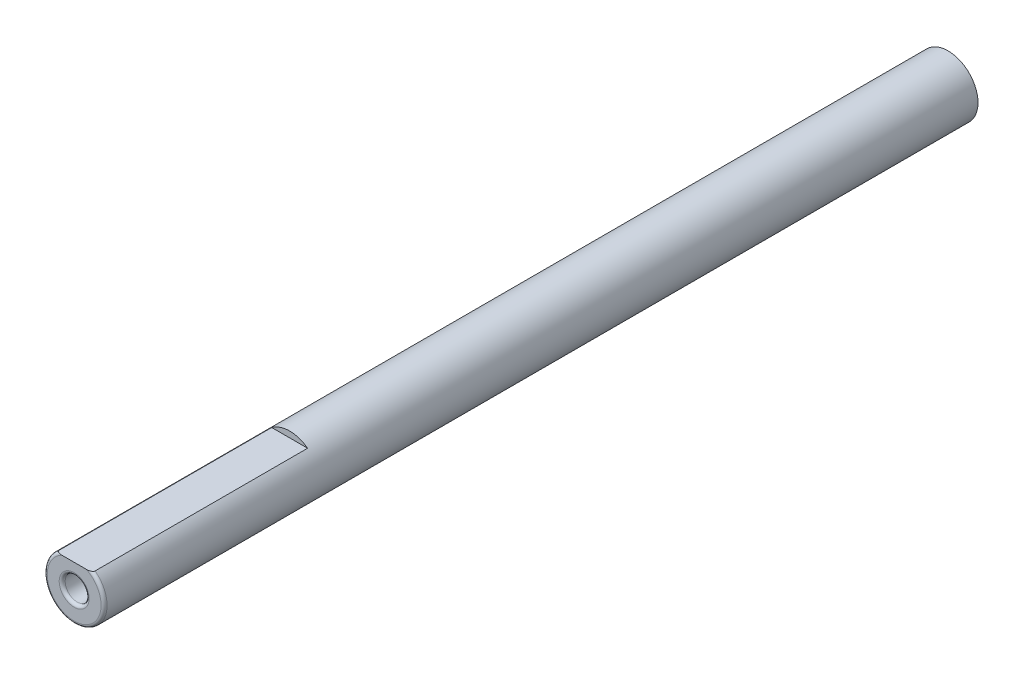
ISO-10303-21;
HEADER;
FILE_DESCRIPTION(('STEP AP214'),'2;1');
FILE_NAME('part.step','',(''),(''),'','','');
FILE_SCHEMA(('AUTOMOTIVE_DESIGN { 1 0 10303 214 1 1 1 1 }'));
ENDSEC;
DATA;
#1=APPLICATION_CONTEXT('core data for automotive mechanical design processes');
#2=APPLICATION_PROTOCOL_DEFINITION('international standard','automotive_design',2000,#1);
#3=PRODUCT_CONTEXT('',#1,'mechanical');
#4=PRODUCT('Part','Part','',(#3));
#5=PRODUCT_RELATED_PRODUCT_CATEGORY('part','',(#4));
#6=PRODUCT_DEFINITION_FORMATION('','',#4);
#7=PRODUCT_DEFINITION_CONTEXT('part definition',#1,'design');
#8=PRODUCT_DEFINITION('design','',#6,#7);
#9=PRODUCT_DEFINITION_SHAPE('','',#8);
#10=(LENGTH_UNIT() NAMED_UNIT(*) SI_UNIT(.MILLI.,.METRE.));
#11=(NAMED_UNIT(*) PLANE_ANGLE_UNIT() SI_UNIT($,.RADIAN.));
#12=(NAMED_UNIT(*) SI_UNIT($,.STERADIAN.) SOLID_ANGLE_UNIT());
#13=UNCERTAINTY_MEASURE_WITH_UNIT(LENGTH_MEASURE(1.E-05),#10,'distance_accuracy_value','');
#14=(GEOMETRIC_REPRESENTATION_CONTEXT(3) GLOBAL_UNCERTAINTY_ASSIGNED_CONTEXT((#13)) GLOBAL_UNIT_ASSIGNED_CONTEXT((#10,
#11,#12)) REPRESENTATION_CONTEXT('',''));
#15=CARTESIAN_POINT('',(0.,0.,0.));
#16=DIRECTION('',(0.,0.,1.));
#17=DIRECTION('',(1.,0.,0.));
#18=AXIS2_PLACEMENT_3D('',#15,#16,#17);
#19=CARTESIAN_POINT('',(0.,0.,73.));
#20=DIRECTION('',(0.,0.,-1.));
#21=DIRECTION('',(-1.,0.,0.));
#22=AXIS2_PLACEMENT_3D('',#19,#20,#21);
#23=CYLINDRICAL_SURFACE('',#22,2.5);
#24=CARTESIAN_POINT('',(0.,0.,72.75));
#25=DIRECTION('',(0.,0.,1.));
#26=DIRECTION('',(1.,0.,0.));
#27=AXIS2_PLACEMENT_3D('',#24,#25,#26);
#28=CIRCLE('',#27,2.5);
#29=CARTESIAN_POINT('',(1.5,2.,72.7499999999999));
#30=VERTEX_POINT('',#29);
#31=CARTESIAN_POINT('',(-1.5,2.,72.7500000000001));
#32=VERTEX_POINT('',#31);
#33=EDGE_CURVE('E82',#30,#32,#28,.F.);
#34=ORIENTED_EDGE('',*,*,#33,.T.);
#35=DIRECTION('',(0.,0.,1.));
#36=VECTOR('',#35,1.);
#37=CARTESIAN_POINT('',(-1.5,2.,55.));
#38=LINE('',#37,#36);
#39=CARTESIAN_POINT('',(-1.5,2.,55.));
#40=VERTEX_POINT('',#39);
#41=EDGE_CURVE('E75',#40,#32,#38,.T.);
#42=ORIENTED_EDGE('',*,*,#41,.F.);
#43=CARTESIAN_POINT('',(0.,0.,55.));
#44=DIRECTION('',(0.,0.,1.));
#45=DIRECTION('',(1.,0.,0.));
#46=AXIS2_PLACEMENT_3D('',#43,#44,#45);
#47=CIRCLE('',#46,2.5);
#48=CARTESIAN_POINT('',(1.5,2.,55.));
#49=VERTEX_POINT('',#48);
#50=EDGE_CURVE('E67',#49,#40,#47,.T.);
#51=ORIENTED_EDGE('',*,*,#50,.F.);
#52=DIRECTION('',(0.,0.,1.));
#53=VECTOR('',#52,1.);
#54=CARTESIAN_POINT('',(1.5,2.,55.));
#55=LINE('',#54,#53);
#56=EDGE_CURVE('E77',#49,#30,#55,.T.);
#57=ORIENTED_EDGE('',*,*,#56,.T.);
#58=EDGE_LOOP('',(#34,#42,#51,#57));
#59=FACE_BOUND('',#58,.T.);
#60=CARTESIAN_POINT('',(0.,0.,0.));
#61=DIRECTION('',(0.,0.,1.));
#62=DIRECTION('',(1.,0.,0.));
#63=AXIS2_PLACEMENT_3D('',#60,#61,#62);
#64=CIRCLE('',#63,2.5);
#65=CARTESIAN_POINT('',(2.5,0.,0.));
#66=VERTEX_POINT('',#65);
#67=EDGE_CURVE('E90',#66,#66,#64,.T.);
#68=ORIENTED_EDGE('',*,*,#67,.T.);
#69=EDGE_LOOP('',(#68));
#70=FACE_BOUND('',#69,.T.);
#71=ADVANCED_FACE('F32',(#59,#70),#23,.T.);
#72=CARTESIAN_POINT('',(0.,0.,73.));
#73=DIRECTION('',(0.,0.,1.));
#74=DIRECTION('',(1.,0.,0.));
#75=AXIS2_PLACEMENT_3D('',#72,#73,#74);
#76=PLANE('',#75);
#77=DIRECTION('',(1.,0.,0.));
#78=VECTOR('',#77,1.);
#79=CARTESIAN_POINT('',(-1.5,2.,73.));
#80=LINE('',#79,#78);
#81=CARTESIAN_POINT('',(-1.03077640640442,2.,73.));
#82=VERTEX_POINT('',#81);
#83=CARTESIAN_POINT('',(1.03077640640442,2.,73.));
#84=VERTEX_POINT('',#83);
#85=EDGE_CURVE('E50',#82,#84,#80,.T.);
#86=ORIENTED_EDGE('',*,*,#85,.F.);
#87=CARTESIAN_POINT('',(0.,0.,73.));
#88=DIRECTION('',(0.,0.,1.));
#89=DIRECTION('',(1.,0.,0.));
#90=AXIS2_PLACEMENT_3D('',#87,#88,#89);
#91=CIRCLE('',#90,2.25);
#92=EDGE_CURVE('E96',#82,#84,#91,.T.);
#93=ORIENTED_EDGE('',*,*,#92,.T.);
#94=EDGE_LOOP('',(#86,#93));
#95=FACE_BOUND('',#94,.T.);
#96=CARTESIAN_POINT('',(0.,0.,73.));
#97=DIRECTION('',(0.,0.,1.));
#98=DIRECTION('',(1.,0.,0.));
#99=AXIS2_PLACEMENT_3D('',#96,#97,#98);
#100=CIRCLE('',#99,1.25);
#101=CARTESIAN_POINT('',(1.25,0.,73.));
#102=VERTEX_POINT('',#101);
#103=EDGE_CURVE('E93',#102,#102,#100,.F.);
#104=ORIENTED_EDGE('',*,*,#103,.T.);
#105=EDGE_LOOP('',(#104));
#106=FACE_BOUND('',#105,.T.);
#107=ADVANCED_FACE('F122',(#95,#106),#76,.T.);
#108=CARTESIAN_POINT('',(0.,0.,0.));
#109=DIRECTION('',(0.,0.,1.));
#110=DIRECTION('',(1.,0.,0.));
#111=AXIS2_PLACEMENT_3D('',#108,#109,#110);
#112=PLANE('',#111);
#113=ORIENTED_EDGE('',*,*,#67,.F.);
#114=EDGE_LOOP('',(#113));
#115=FACE_BOUND('',#114,.T.);
#116=ADVANCED_FACE('F120',(#115),#112,.F.);
#117=CARTESIAN_POINT('',(0.,0.,63.));
#118=DIRECTION('',(0.,0.,1.));
#119=DIRECTION('',(1.,0.,0.));
#120=AXIS2_PLACEMENT_3D('',#117,#118,#119);
#121=CYLINDRICAL_SURFACE('',#120,1.);
#122=CARTESIAN_POINT('',(0.,0.,72.75));
#123=DIRECTION('',(0.,0.,1.));
#124=DIRECTION('',(1.,0.,0.));
#125=AXIS2_PLACEMENT_3D('',#122,#123,#124);
#126=CIRCLE('',#125,1.);
#127=CARTESIAN_POINT('',(1.,0.,72.75));
#128=VERTEX_POINT('',#127);
#129=EDGE_CURVE('E100',#128,#128,#126,.T.);
#130=ORIENTED_EDGE('',*,*,#129,.T.);
#131=EDGE_LOOP('',(#130));
#132=FACE_BOUND('',#131,.T.);
#133=CARTESIAN_POINT('',(0.,0.,63.));
#134=DIRECTION('',(0.,0.,1.));
#135=DIRECTION('',(1.,0.,0.));
#136=AXIS2_PLACEMENT_3D('',#133,#134,#135);
#137=CIRCLE('',#136,1.);
#138=CARTESIAN_POINT('',(1.,0.,63.));
#139=VERTEX_POINT('',#138);
#140=EDGE_CURVE('E84',#139,#139,#137,.T.);
#141=ORIENTED_EDGE('',*,*,#140,.F.);
#142=EDGE_LOOP('',(#141));
#143=FACE_BOUND('',#142,.T.);
#144=ADVANCED_FACE('F116',(#132,#143),#121,.F.);
#145=CARTESIAN_POINT('',(0.,0.,63.));
#146=DIRECTION('',(0.,0.,1.));
#147=DIRECTION('',(1.,0.,0.));
#148=AXIS2_PLACEMENT_3D('',#145,#146,#147);
#149=PLANE('',#148);
#150=ORIENTED_EDGE('',*,*,#140,.T.);
#151=EDGE_LOOP('',(#150));
#152=FACE_BOUND('',#151,.T.);
#153=ADVANCED_FACE('F112',(#152),#149,.T.);
#154=CARTESIAN_POINT('',(0.,0.,72.75));
#155=DIRECTION('',(0.,0.,1.));
#156=DIRECTION('',(1.,0.,0.));
#157=AXIS2_PLACEMENT_3D('',#154,#155,#156);
#158=TOROIDAL_SURFACE('',#157,2.25,0.25);
#159=CARTESIAN_POINT('',(0.,2.,72.75));
#160=CARTESIAN_POINT('',(4.60447977303265E-11,2.,72.7499994316429));
#161=CARTESIAN_POINT('',(-1.41908550602303E-07,2.,72.7499988632743));
#162=CARTESIAN_POINT('',(-5.76353339906845E-07,2.,72.7499977781027));
#163=CARTESIAN_POINT('',(-8.74667841472388E-07,2.,72.7499972642924));
#164=CARTESIAN_POINT('',(-1.58830851072497E-06,2.,72.7499962318158));
#165=CARTESIAN_POINT('',(-2.01336970471725E-06,2.,72.7499957199378));
#166=CARTESIAN_POINT('',(-2.92050402588945E-06,2.,72.7499947653601));
#167=CARTESIAN_POINT('',(-3.40176908275082E-06,2.,72.7499943218515));
#168=CARTESIAN_POINT('',(-5.16120523871155E-06,2.,72.7499927957832));
#169=CARTESIAN_POINT('',(-6.51185935230377E-06,2.,72.7499917950806));
#170=CARTESIAN_POINT('',(-9.27139545432669E-06,2.,72.7499900473241));
#171=CARTESIAN_POINT('',(-1.06743625450931E-05,2.,72.7499892903939));
#172=CARTESIAN_POINT('',(-1.62751541471673E-05,2.,72.7499863594714));
#173=CARTESIAN_POINT('',(-2.05492369434243E-05,2.,72.7499843227497));
#174=CARTESIAN_POINT('',(-2.88801261241239E-05,2.,72.7499810780406));
#175=CARTESIAN_POINT('',(-3.29122661772375E-05,2.,72.7499798052807));
#176=CARTESIAN_POINT('',(-5.04259066721469E-05,2.,72.7499742542971));
#177=CARTESIAN_POINT('',(-6.38826425216419E-05,2.,72.7499699305427));
#178=CARTESIAN_POINT('',(-8.88660289024995E-05,2.,72.7499631374884));
#179=CARTESIAN_POINT('',(-0.000100338676296863,2.,72.7499604789156));
#180=CARTESIAN_POINT('',(-0.000185124340216107,2.,72.7499390482678));
#181=CARTESIAN_POINT('',(-0.000255773108726864,2.,72.7499112057745));
#182=CARTESIAN_POINT('',(-0.000532607014025581,2.,72.7498060419901));
#183=CARTESIAN_POINT('',(-0.000740642204593965,2.,72.7497354879975));
#184=CARTESIAN_POINT('',(-0.00155567627210226,2.,72.7494550516329));
#185=CARTESIAN_POINT('',(-0.00216078794606,2.,72.7492380769761));
#186=CARTESIAN_POINT('',(-0.00465350185408532,2.,72.7483483993295));
#187=CARTESIAN_POINT('',(-0.00654317925328613,2.,72.7476837068595));
#188=CARTESIAN_POINT('',(-0.0300915261017926,2.,72.7393953655063));
#189=CARTESIAN_POINT('',(-0.0517374851104857,2.,72.7317214729732));
#190=CARTESIAN_POINT('',(-0.0942333116038087,2.,72.7167477137537));
#191=CARTESIAN_POINT('',(-0.115082176781415,2.,72.7094447144517));
#192=CARTESIAN_POINT('',(-0.159322374256499,2.,72.6940525866924));
#193=CARTESIAN_POINT('',(-0.182717690014827,2.,72.6859746349159));
#194=CARTESIAN_POINT('',(-0.229815647900605,2.,72.669919309923));
#195=CARTESIAN_POINT('',(-0.253518947339876,2.,72.6619438690271));
#196=CARTESIAN_POINT('',(-0.311826142248261,2.,72.6426698197981));
#197=CARTESIAN_POINT('',(-0.346477126851886,2.,72.6315123163205));
#198=CARTESIAN_POINT('',(-0.415171679035175,2.,72.6102184444254));
#199=CARTESIAN_POINT('',(-0.449209574097834,2.,72.6000638634305));
#200=CARTESIAN_POINT('',(-0.524827793365206,2.,72.5786480090876));
#201=CARTESIAN_POINT('',(-0.566472539762494,2.,72.5676107181456));
#202=CARTESIAN_POINT('',(-0.650541284700983,2.,72.5473352607342));
#203=CARTESIAN_POINT('',(-0.692968806795766,2.,72.5381114956025));
#204=CARTESIAN_POINT('',(-0.781376171359561,2.,72.5215918239718));
#205=CARTESIAN_POINT('',(-0.82739214697705,2.,72.5144821434608));
#206=CARTESIAN_POINT('',(-0.919736872009351,2.,72.5041122818566));
#207=CARTESIAN_POINT('',(-0.966064272962934,2.,72.5008406421505));
#208=CARTESIAN_POINT('',(-1.05795604981798,2.,72.4994507366684));
#209=CARTESIAN_POINT('',(-1.10351709384425,2.,72.5012304297803));
#210=CARTESIAN_POINT('',(-1.17088745971757,2.,72.509007957349));
#211=CARTESIAN_POINT('',(-1.19299708974847,2.,72.5124015898682));
#212=CARTESIAN_POINT('',(-1.23680593555489,2.,72.5211858923293));
#213=CARTESIAN_POINT('',(-1.25850564230334,2.,72.5265739899152));
#214=CARTESIAN_POINT('',(-1.29544204153703,2.,72.5380012323008));
#215=CARTESIAN_POINT('',(-1.31085143131575,2.,72.5434783330444));
#216=CARTESIAN_POINT('',(-1.34110600031854,2.,72.5559663060975));
#217=CARTESIAN_POINT('',(-1.35594925807522,2.,72.5629819357195));
#218=CARTESIAN_POINT('',(-1.38479216759413,2.,72.5788548815429));
#219=CARTESIAN_POINT('',(-1.39878393065522,2.,72.5877267850515));
#220=CARTESIAN_POINT('',(-1.42520200026815,2.,72.6075539977369));
#221=CARTESIAN_POINT('',(-1.43763283447314,2.,72.6185030385383));
#222=CARTESIAN_POINT('',(-1.45594558128021,2.,72.6382661622678));
#223=CARTESIAN_POINT('',(-1.46256060850522,2.,72.6463981694095));
#224=CARTESIAN_POINT('',(-1.47448734144706,2.,72.6635801193661));
#225=CARTESIAN_POINT('',(-1.47979954325568,2.,72.6726297109208));
#226=CARTESIAN_POINT('',(-1.4888042831766,2.,72.6916429485455));
#227=CARTESIAN_POINT('',(-1.49247789218271,2.,72.7016157469127));
#228=CARTESIAN_POINT('',(-1.4977546215247,2.,72.7220946264925));
#229=CARTESIAN_POINT('',(-1.4993607714795,2.,72.7325999038847));
#230=CARTESIAN_POINT('',(-1.50025612399369,2.,72.7521656496195));
#231=CARTESIAN_POINT('',(-1.49984935091474,2.,72.7612131412387));
#232=CARTESIAN_POINT('',(-1.49743800054558,2.,72.7790915807672));
#233=CARTESIAN_POINT('',(-1.49543319727238,2.,72.7879224978678));
#234=CARTESIAN_POINT('',(-1.49011626106806,2.,72.8047173917484));
#235=CARTESIAN_POINT('',(-1.48686986628215,2.,72.8127026038318));
#236=CARTESIAN_POINT('',(-1.47927184985139,2.,72.8281220840651));
#237=CARTESIAN_POINT('',(-1.47491993343345,2.,72.8355562045894));
#238=CARTESIAN_POINT('',(-1.46269764328602,2.,72.8536899008064));
#239=CARTESIAN_POINT('',(-1.45420072584848,2.,72.8639674141153));
#240=CARTESIAN_POINT('',(-1.43568647628947,2.,72.8830542623536));
#241=CARTESIAN_POINT('',(-1.42566468441951,2.,72.8918591262967));
#242=CARTESIAN_POINT('',(-1.39857920170747,2.,72.9127249221272));
#243=CARTESIAN_POINT('',(-1.38075240757578,2.,72.9237893243213));
#244=CARTESIAN_POINT('',(-1.34369856944897,2.,72.9431007540513));
#245=CARTESIAN_POINT('',(-1.32447116450517,2.,72.9513470522007));
#246=CARTESIAN_POINT('',(-1.26994219182624,2.,72.9710829325379));
#247=CARTESIAN_POINT('',(-1.23376006001226,2.,72.9801133803287));
#248=CARTESIAN_POINT('',(-1.16013658314661,2.,72.9930436841324));
#249=CARTESIAN_POINT('',(-1.12268499148503,2.,72.9968754570902));
#250=CARTESIAN_POINT('',(-1.04579087740824,2.,73.0006213397396));
#251=CARTESIAN_POINT('',(-1.00633987556636,2.,73.0003364681251));
#252=CARTESIAN_POINT('',(-0.927531406020384,2.,72.9963988575985));
#253=CARTESIAN_POINT('',(-0.888174458526564,2.,72.9927372482254));
#254=CARTESIAN_POINT('',(-0.811901156366958,2.,72.9830511422734));
#255=CARTESIAN_POINT('',(-0.774966747019161,2.,72.9771633343099));
#256=CARTESIAN_POINT('',(-0.701685223215932,2.,72.96356089772));
#257=CARTESIAN_POINT('',(-0.665335870587718,2.,72.9558580770136));
#258=CARTESIAN_POINT('',(-0.58391137086121,2.,72.9368764373918));
#259=CARTESIAN_POINT('',(-0.538933431232725,2.,72.9251852474934));
#260=CARTESIAN_POINT('',(-0.448377262369036,2.,72.8998306275539));
#261=CARTESIAN_POINT('',(-0.402810630561023,2.,72.8861265101856));
#262=CARTESIAN_POINT('',(-0.3265122946677,2.,72.8620713997275));
#263=CARTESIAN_POINT('',(-0.295677630405276,2.,72.8520424549339));
#264=CARTESIAN_POINT('',(-0.234465688968832,2.,72.8316830489772));
#265=CARTESIAN_POINT('',(-0.204086998858635,2.,72.8213568325791));
#266=CARTESIAN_POINT('',(-0.146686277930417,2.,72.8015866863205));
#267=CARTESIAN_POINT('',(-0.119655506533312,2.,72.7921676795406));
#268=CARTESIAN_POINT('',(-0.0645649660808965,2.,72.7728082194009));
#269=CARTESIAN_POINT('',(-0.0365071115508402,2.,72.7628619428912));
#270=CARTESIAN_POINT('',(-0.00654211704730713,2.,72.7523159731014));
#271=CARTESIAN_POINT('',(-0.00465140018735257,2.,72.7516508728745));
#272=CARTESIAN_POINT('',(-0.00215844070804889,2.,72.7507610921868));
#273=CARTESIAN_POINT('',(-0.00155412671966729,2.,72.7505444048271));
#274=CARTESIAN_POINT('',(-0.00074009960082364,2.,72.7502643151903));
#275=CARTESIAN_POINT('',(-0.000532271204908929,2.,72.7501938316014));
#276=CARTESIAN_POINT('',(-0.000255678863852791,2.,72.7500887612275));
#277=CARTESIAN_POINT('',(-0.000185066943918879,2.,72.7500609333125));
#278=CARTESIAN_POINT('',(-0.000100322608490237,2.,72.7500395106224));
#279=CARTESIAN_POINT('',(-8.88525266506745E-05,2.,72.7500368523305));
#280=CARTESIAN_POINT('',(-6.38748846006629E-05,2.,72.7500300610194));
#281=CARTESIAN_POINT('',(-5.04212595587593E-05,2.,72.7500257389672));
#282=CARTESIAN_POINT('',(-3.29110992125345E-05,2.,72.7500201900559));
#283=CARTESIAN_POINT('',(-2.88793376451717E-05,2.,72.7500189176432));
#284=CARTESIAN_POINT('',(-2.05491783617792E-05,2.,72.7500156738718));
#285=CARTESIAN_POINT('',(-1.62754315141246E-05,2.,72.7500136377687));
#286=CARTESIAN_POINT('',(-1.0674965165193E-05,2.,72.7500107076901));
#287=CARTESIAN_POINT('',(-9.27202715098322E-06,2.,72.75000995095));
#288=CARTESIAN_POINT('',(-6.51251274781188E-06,2.,72.7500082036104));
#289=CARTESIAN_POINT('',(-5.16184878506824E-06,2.,72.7500072031365));
#290=CARTESIAN_POINT('',(-3.40235596668459E-06,2.,72.7500056773855));
#291=CARTESIAN_POINT('',(-2.92106572946966E-06,2.,72.7500052339612));
#292=CARTESIAN_POINT('',(-2.0138658940959E-06,2.,72.7500042795533));
#293=CARTESIAN_POINT('',(-1.58876411934483E-06,2.,72.750003767761));
#294=CARTESIAN_POINT('',(-8.75025822030296E-07,2.,72.7500027354385));
#295=CARTESIAN_POINT('',(-5.76656751638861E-07,2.,72.7500022216969));
#296=CARTESIAN_POINT('',(-1.42078324048704E-07,2.,72.7500011366452));
#297=CARTESIAN_POINT('',(-4.60424628416048E-11,2.,72.7500005683283));
#298=CARTESIAN_POINT('',(0.,2.,72.75));
#299=B_SPLINE_CURVE_WITH_KNOTS('',3,(#159,#160,#161,#162,#163,#164,#165,#166,#167,#168,#169,
#170,#171,#172,#173,#174,#175,#176,#177,#178,#179,#180,#181,#182,#183,#184,#185,#186,#187,#188,
#189,#190,#191,#192,#193,#194,#195,#196,#197,#198,#199,#200,#201,#202,#203,#204,#205,#206,#207,
#208,#209,#210,#211,#212,#213,#214,#215,#216,#217,#218,#219,#220,#221,#222,#223,#224,#225,#226,
#227,#228,#229,#230,#231,#232,#233,#234,#235,#236,#237,#238,#239,#240,#241,#242,#243,#244,#245,
#246,#247,#248,#249,#250,#251,#252,#253,#254,#255,#256,#257,#258,#259,#260,#261,#262,#263,#264,
#265,#266,#267,#268,#269,#270,#271,#272,#273,#274,#275,#276,#277,#278,#279,#280,#281,#282,#283,
#284,#285,#286,#287,#288,#289,#290,#291,#292,#293,#294,#295,#296,#297,#298),.UNSPECIFIED.,.T.,
.F.,(4,2,2,2,2,2,2,2,2,2,2,2,2,2,2,2,2,2,2,2,2,2,2,2,2,2,2,2,2,2,2,2,2,2,2,2,2,2,2,2,2,2,2,2,2,
2,2,2,2,2,2,2,2,2,2,2,2,2,2,2,2,2,2,2,2,2,2,2,2,4),(0.,1.70593035754983E-06,3.4804658583349E-06,
5.46753033564972E-06,7.42890667995629E-06,1.24485924666463E-05,1.72271182687607E-05,
3.13927484906151E-05,4.40635450768334E-05,8.64616498880931E-05,0.000121762237206279,
0.000348850482877824,0.00100847484033568,0.00293621966333802,0.00894655901506832,
0.0778383472405246,0.144112489335173,0.218363391967703,0.293389980060125,0.402592342745507,
0.509143961873857,0.638358099772787,0.768560207489545,0.908121033225023,1.04726412591419,
1.18361653594968,1.2506541534458,1.31760560891086,1.36660331871871,1.41575472682726,
1.46530795846393,1.51471396126739,1.5460644460136,1.57740297447624,1.60909470217474,
1.64073993629355,1.66776519339683,1.6947942729133,1.72055542472725,1.74632345264265,
1.78610098132831,1.82599716528658,1.88858578653762,1.95119059483526,2.06244350384283,
2.17513978134689,2.2933008128236,2.41177313223176,2.52391605555674,2.63534862894128,
2.77471957137366,2.91744408194628,3.01471503377711,3.11096974529615,3.19684574578844,
3.2861434934468,3.29215717001634,3.29408237339145,3.29474134143121,3.29496831139007,
3.29500360432053,3.29504599202879,3.29505866143623,3.29507282538385,3.29507760356316,
3.29508262287079,3.29508458413177,3.29508657107786,3.29508834551867,3.29509005136252),.UNSPECIFIED.);
#300=EDGE_CURVE('E11',#32,#82,#299,.T.);
#301=ORIENTED_EDGE('',*,*,#300,.F.);
#302=ORIENTED_EDGE('',*,*,#33,.F.);
#303=CARTESIAN_POINT('',(0.,2.,72.75));
#304=CARTESIAN_POINT('',(-4.60434786703754E-11,2.,72.7500005683571));
#305=CARTESIAN_POINT('',(1.41908553257205E-07,2.,72.7500011367256));
#306=CARTESIAN_POINT('',(5.76353340426851E-07,2.,72.7500022218973));
#307=CARTESIAN_POINT('',(8.7466784046892E-07,2.,72.7500027357075));
#308=CARTESIAN_POINT('',(1.58830850927223E-06,2.,72.7500037681842));
#309=CARTESIAN_POINT('',(2.0133697043223E-06,2.,72.7500042800621));
#310=CARTESIAN_POINT('',(2.92050402628935E-06,2.,72.7500052346399));
#311=CARTESIAN_POINT('',(3.40176908290468E-06,2.,72.7500056781485));
#312=CARTESIAN_POINT('',(5.16120523834448E-06,2.,72.7500072042168));
#313=CARTESIAN_POINT('',(6.51185935221436E-06,2.,72.7500082049194));
#314=CARTESIAN_POINT('',(9.27139545444125E-06,2.,72.7500099526759));
#315=CARTESIAN_POINT('',(1.06743625451502E-05,2.,72.7500107096061));
#316=CARTESIAN_POINT('',(1.62751541470862E-05,2.,72.7500136405286));
#317=CARTESIAN_POINT('',(2.05492369434346E-05,2.,72.7500156772503));
#318=CARTESIAN_POINT('',(2.88801261242058E-05,2.,72.7500189219594));
#319=CARTESIAN_POINT('',(3.29122661773103E-05,2.,72.7500201947193));
#320=CARTESIAN_POINT('',(5.04259066722136E-05,2.,72.7500257457029));
#321=CARTESIAN_POINT('',(6.38826425217683E-05,2.,72.7500300694573));
#322=CARTESIAN_POINT('',(8.88660289027005E-05,2.,72.7500368625116));
#323=CARTESIAN_POINT('',(0.000100338676297084,2.,72.7500395210844));
#324=CARTESIAN_POINT('',(0.000185124340216527,2.,72.7500609517322));
#325=CARTESIAN_POINT('',(0.000255773108727507,2.,72.7500887942255));
#326=CARTESIAN_POINT('',(0.000532607014027112,2.,72.7501939580099));
#327=CARTESIAN_POINT('',(0.000740642204596138,2.,72.7502645120024));
#328=CARTESIAN_POINT('',(0.00155567627210431,2.,72.7505449483671));
#329=CARTESIAN_POINT('',(0.00216078794606098,2.,72.7507619230239));
#330=CARTESIAN_POINT('',(0.00465350185408482,2.,72.7516516006705));
#331=CARTESIAN_POINT('',(0.0065431792532859,2.,72.7523162931405));
#332=CARTESIAN_POINT('',(0.0300915261017958,2.,72.7606046344937));
#333=CARTESIAN_POINT('',(0.0517374851104877,2.,72.7682785270267));
#334=CARTESIAN_POINT('',(0.0942333116038076,2.,72.7832522862463));
#335=CARTESIAN_POINT('',(0.115082176781412,2.,72.7905552855483));
#336=CARTESIAN_POINT('',(0.159322374256495,2.,72.8059474133076));
#337=CARTESIAN_POINT('',(0.182717690014826,2.,72.8140253650841));
#338=CARTESIAN_POINT('',(0.229815647900605,2.,72.830080690077));
#339=CARTESIAN_POINT('',(0.253518947339875,2.,72.8380561309729));
#340=CARTESIAN_POINT('',(0.311826142248259,2.,72.8573301802019));
#341=CARTESIAN_POINT('',(0.346477126851886,2.,72.8684876836795));
#342=CARTESIAN_POINT('',(0.415171679035175,2.,72.8897815555746));
#343=CARTESIAN_POINT('',(0.449209574097834,2.,72.8999361365695));
#344=CARTESIAN_POINT('',(0.524827793365206,2.,72.9213519909124));
#345=CARTESIAN_POINT('',(0.566472539762494,2.,72.9323892818544));
#346=CARTESIAN_POINT('',(0.650541284700983,2.,72.9526647392658));
#347=CARTESIAN_POINT('',(0.692968806795766,2.,72.9618885043975));
#348=CARTESIAN_POINT('',(0.781376171359561,2.,72.9784081760281));
#349=CARTESIAN_POINT('',(0.82739214697705,2.,72.9855178565392));
#350=CARTESIAN_POINT('',(0.919736872009351,2.,72.9958877181434));
#351=CARTESIAN_POINT('',(0.966064272962934,2.,72.9991593578495));
#352=CARTESIAN_POINT('',(1.05795604981798,2.,73.0005492633316));
#353=CARTESIAN_POINT('',(1.10351709384425,2.,72.9987695702196));
#354=CARTESIAN_POINT('',(1.17088745971757,2.,72.990992042651));
#355=CARTESIAN_POINT('',(1.19299708974847,2.,72.9875984101318));
#356=CARTESIAN_POINT('',(1.23680593555489,2.,72.9788141076707));
#357=CARTESIAN_POINT('',(1.25850564230334,2.,72.9734260100848));
#358=CARTESIAN_POINT('',(1.29544204153703,2.,72.9619987676992));
#359=CARTESIAN_POINT('',(1.31085143131576,2.,72.9565216669556));
#360=CARTESIAN_POINT('',(1.34110600031855,2.,72.9440336939025));
#361=CARTESIAN_POINT('',(1.35594925807522,2.,72.9370180642805));
#362=CARTESIAN_POINT('',(1.38479216759413,2.,72.9211451184571));
#363=CARTESIAN_POINT('',(1.39878393065521,2.,72.9122732149485));
#364=CARTESIAN_POINT('',(1.42520200026814,2.,72.8924460022631));
#365=CARTESIAN_POINT('',(1.43763283447314,2.,72.8814969614617));
#366=CARTESIAN_POINT('',(1.45594558128021,2.,72.8617338377322));
#367=CARTESIAN_POINT('',(1.46256060850522,2.,72.8536018305905));
#368=CARTESIAN_POINT('',(1.47448734144706,2.,72.8364198806339));
#369=CARTESIAN_POINT('',(1.47979954325568,2.,72.8273702890792));
#370=CARTESIAN_POINT('',(1.4888042831766,2.,72.8083570514545));
#371=CARTESIAN_POINT('',(1.49247789218271,2.,72.7983842530873));
#372=CARTESIAN_POINT('',(1.4977546215247,2.,72.7779053735075));
#373=CARTESIAN_POINT('',(1.4993607714795,2.,72.7674000961153));
#374=CARTESIAN_POINT('',(1.50025612399369,2.,72.7478343503805));
#375=CARTESIAN_POINT('',(1.49984935091474,2.,72.7387868587613));
#376=CARTESIAN_POINT('',(1.49743800054558,2.,72.7209084192328));
#377=CARTESIAN_POINT('',(1.49543319727238,2.,72.7120775021322));
#378=CARTESIAN_POINT('',(1.49011626106806,2.,72.6952826082516));
#379=CARTESIAN_POINT('',(1.48686986628215,2.,72.6872973961681));
#380=CARTESIAN_POINT('',(1.47927184985139,2.,72.6718779159349));
#381=CARTESIAN_POINT('',(1.47491993343345,2.,72.6644437954106));
#382=CARTESIAN_POINT('',(1.46269764328602,2.,72.6463100991936));
#383=CARTESIAN_POINT('',(1.45420072584847,2.,72.6360325858847));
#384=CARTESIAN_POINT('',(1.43568647628946,2.,72.6169457376464));
#385=CARTESIAN_POINT('',(1.4256646844195,2.,72.6081408737033));
#386=CARTESIAN_POINT('',(1.39857920170747,2.,72.5872750778728));
#387=CARTESIAN_POINT('',(1.38075240757578,2.,72.5762106756787));
#388=CARTESIAN_POINT('',(1.34369856944897,2.,72.5568992459487));
#389=CARTESIAN_POINT('',(1.32447116450517,2.,72.5486529477993));
#390=CARTESIAN_POINT('',(1.26994219182624,2.,72.5289170674621));
#391=CARTESIAN_POINT('',(1.23376006001226,2.,72.5198866196713));
#392=CARTESIAN_POINT('',(1.16013658314661,2.,72.5069563158676));
#393=CARTESIAN_POINT('',(1.12268499148503,2.,72.5031245429098));
#394=CARTESIAN_POINT('',(1.04579087740824,2.,72.4993786602604));
#395=CARTESIAN_POINT('',(1.00633987556637,2.,72.4996635318749));
#396=CARTESIAN_POINT('',(0.927531406020385,2.,72.5036011424015));
#397=CARTESIAN_POINT('',(0.888174458526564,2.,72.5072627517746));
#398=CARTESIAN_POINT('',(0.811901156366958,2.,72.5169488577266));
#399=CARTESIAN_POINT('',(0.774966747019161,2.,72.5228366656901));
#400=CARTESIAN_POINT('',(0.701685223215932,2.,72.53643910228));
#401=CARTESIAN_POINT('',(0.665335870587718,2.,72.5441419229864));
#402=CARTESIAN_POINT('',(0.58391137086121,2.,72.5631235626082));
#403=CARTESIAN_POINT('',(0.538933431232725,2.,72.5748147525066));
#404=CARTESIAN_POINT('',(0.448377262369036,2.,72.6001693724461));
#405=CARTESIAN_POINT('',(0.402810630561023,2.,72.6138734898144));
#406=CARTESIAN_POINT('',(0.3265122946677,2.,72.6379286002725));
#407=CARTESIAN_POINT('',(0.295677630405277,2.,72.6479575450661));
#408=CARTESIAN_POINT('',(0.234465688968834,2.,72.6683169510228));
#409=CARTESIAN_POINT('',(0.204086998858638,2.,72.6786431674209));
#410=CARTESIAN_POINT('',(0.146686277930419,2.,72.6984133136795));
#411=CARTESIAN_POINT('',(0.119655506533312,2.,72.7078323204594));
#412=CARTESIAN_POINT('',(0.0645649660808963,2.,72.7271917805991));
#413=CARTESIAN_POINT('',(0.0365071115508408,2.,72.7371380571088));
#414=CARTESIAN_POINT('',(0.00654211704730709,2.,72.7476840268986));
#415=CARTESIAN_POINT('',(0.00465140018735248,2.,72.7483491271255));
#416=CARTESIAN_POINT('',(0.00215844070804892,2.,72.7492389078132));
#417=CARTESIAN_POINT('',(0.00155412671966737,2.,72.7494555951729));
#418=CARTESIAN_POINT('',(0.000740099600823663,2.,72.7497356848097));
#419=CARTESIAN_POINT('',(0.000532271204908962,2.,72.7498061683986));
#420=CARTESIAN_POINT('',(0.000255678863852962,2.,72.7499112387725));
#421=CARTESIAN_POINT('',(0.000185066943919074,2.,72.7499390666875));
#422=CARTESIAN_POINT('',(0.000100322608490192,2.,72.7499604893776));
#423=CARTESIAN_POINT('',(8.88525266504787E-05,2.,72.7499631476695));
#424=CARTESIAN_POINT('',(6.38748846004508E-05,2.,72.7499699389806));
#425=CARTESIAN_POINT('',(5.04212595586826E-05,2.,72.7499742610328));
#426=CARTESIAN_POINT('',(3.29110992125756E-05,2.,72.7499798099441));
#427=CARTESIAN_POINT('',(2.88793376452103E-05,2.,72.7499810823568));
#428=CARTESIAN_POINT('',(2.05491783618034E-05,2.,72.7499843261282));
#429=CARTESIAN_POINT('',(1.62754315141362E-05,2.,72.7499863622313));
#430=CARTESIAN_POINT('',(1.06749651652098E-05,2.,72.7499892923099));
#431=CARTESIAN_POINT('',(9.27202715100352E-06,2.,72.74999004905));
#432=CARTESIAN_POINT('',(6.51251274781249E-06,2.,72.7499917963896));
#433=CARTESIAN_POINT('',(5.16184878504438E-06,2.,72.7499927968634));
#434=CARTESIAN_POINT('',(3.40235596670117E-06,2.,72.7499943226144));
#435=CARTESIAN_POINT('',(2.92106572950588E-06,2.,72.7499947660388));
#436=CARTESIAN_POINT('',(2.01386589406626E-06,2.,72.7499957204467));
#437=CARTESIAN_POINT('',(1.58876411922834E-06,2.,72.749996232239));
#438=CARTESIAN_POINT('',(8.75025822137661E-07,2.,72.7499972645615));
#439=CARTESIAN_POINT('',(5.76656752015406E-07,2.,72.7499977783031));
#440=CARTESIAN_POINT('',(1.42078323687811E-07,2.,72.7499988633548));
#441=CARTESIAN_POINT('',(4.60411442148932E-11,2.,72.7499994316717));
#442=CARTESIAN_POINT('',(0.,2.,72.75));
#443=B_SPLINE_CURVE_WITH_KNOTS('',3,(#303,#304,#305,#306,#307,#308,#309,#310,#311,#312,#313,
#314,#315,#316,#317,#318,#319,#320,#321,#322,#323,#324,#325,#326,#327,#328,#329,#330,#331,#332,
#333,#334,#335,#336,#337,#338,#339,#340,#341,#342,#343,#344,#345,#346,#347,#348,#349,#350,#351,
#352,#353,#354,#355,#356,#357,#358,#359,#360,#361,#362,#363,#364,#365,#366,#367,#368,#369,#370,
#371,#372,#373,#374,#375,#376,#377,#378,#379,#380,#381,#382,#383,#384,#385,#386,#387,#388,#389,
#390,#391,#392,#393,#394,#395,#396,#397,#398,#399,#400,#401,#402,#403,#404,#405,#406,#407,#408,
#409,#410,#411,#412,#413,#414,#415,#416,#417,#418,#419,#420,#421,#422,#423,#424,#425,#426,#427,
#428,#429,#430,#431,#432,#433,#434,#435,#436,#437,#438,#439,#440,#441,#442),.UNSPECIFIED.,.T.,
.F.,(4,2,2,2,2,2,2,2,2,2,2,2,2,2,2,2,2,2,2,2,2,2,2,2,2,2,2,2,2,2,2,2,2,2,2,2,2,2,2,2,2,2,2,2,2,
2,2,2,2,2,2,2,2,2,2,2,2,2,2,2,2,2,2,2,2,2,2,2,2,4),(0.,1.70593034397578E-06,
3.48046585691602E-06,5.46753033423238E-06,7.42890667854064E-06,1.24485924652368E-05,
1.7227118267357E-05,3.13927484892357E-05,4.40635450754738E-05,8.64616498868282E-05,
0.000121762237205087,0.000348850482877217,0.00100847484033687,0.0029362196633366,
0.0089465590150669,0.0778383472405245,0.144112489335168,0.218363391967695,0.293389980060123,
0.402592342745506,0.509143961873855,0.638358099772785,0.768560207489543,0.908121033225021,
1.04726412591419,1.18361653594968,1.2506541534458,1.31760560891086,1.36660331871872,
1.41575472682725,1.46530795846392,1.51471396126739,1.5460644460136,1.57740297447624,
1.60909470217474,1.64073993629354,1.66776519339683,1.6947942729133,1.72055542472725,
1.74632345264265,1.78610098132833,1.82599716528657,1.88858578653762,1.95119059483526,
2.06244350384283,2.17513978134689,2.29330081282359,2.41177313223176,2.52391605555674,
2.63534862894127,2.77471957137366,2.91744408194627,3.0147150337771,3.11096974529614,
3.19684574578844,3.2861434934468,3.29215717001633,3.29408237339145,3.29474134143121,
3.29496831139006,3.29500360432053,3.29504599202879,3.29505866143623,3.29507282538385,
3.29507760356316,3.29508262287079,3.29508458413177,3.29508657107785,3.29508834551866,
3.29509005136252),.UNSPECIFIED.);
#444=EDGE_CURVE('E44',#84,#30,#443,.T.);
#445=ORIENTED_EDGE('',*,*,#444,.F.);
#446=ORIENTED_EDGE('',*,*,#92,.F.);
#447=EDGE_LOOP('',(#301,#302,#445,#446));
#448=FACE_BOUND('',#447,.T.);
#449=ADVANCED_FACE('F105',(#448),#158,.T.);
#450=CARTESIAN_POINT('',(0.,0.,72.75));
#451=DIRECTION('',(0.,0.,1.));
#452=DIRECTION('',(1.,0.,0.));
#453=AXIS2_PLACEMENT_3D('',#450,#451,#452);
#454=TOROIDAL_SURFACE('',#453,1.25,0.25);
#455=ORIENTED_EDGE('',*,*,#103,.F.);
#456=EDGE_LOOP('',(#455));
#457=FACE_BOUND('',#456,.T.);
#458=ORIENTED_EDGE('',*,*,#129,.F.);
#459=EDGE_LOOP('',(#458));
#460=FACE_BOUND('',#459,.T.);
#461=ADVANCED_FACE('F34',(#457,#460),#454,.T.);
#462=CARTESIAN_POINT('',(-1.5,2.,55.));
#463=DIRECTION('',(0.,-1.,0.));
#464=DIRECTION('',(0.,0.,-1.));
#465=AXIS2_PLACEMENT_3D('',#462,#463,#464);
#466=PLANE('',#465);
#467=ORIENTED_EDGE('',*,*,#300,.T.);
#468=ORIENTED_EDGE('',*,*,#85,.T.);
#469=ORIENTED_EDGE('',*,*,#444,.T.);
#470=ORIENTED_EDGE('',*,*,#56,.F.);
#471=DIRECTION('',(1.,0.,0.));
#472=VECTOR('',#471,1.);
#473=CARTESIAN_POINT('',(-1.5,2.,55.));
#474=LINE('',#473,#472);
#475=EDGE_CURVE('E70',#40,#49,#474,.T.);
#476=ORIENTED_EDGE('',*,*,#475,.F.);
#477=ORIENTED_EDGE('',*,*,#41,.T.);
#478=EDGE_LOOP('',(#467,#468,#469,#470,#476,#477));
#479=FACE_BOUND('',#478,.T.);
#480=ADVANCED_FACE('F74',(#479),#466,.F.);
#481=CARTESIAN_POINT('',(0.,0.,55.));
#482=DIRECTION('',(0.,0.,1.));
#483=DIRECTION('',(1.,0.,0.));
#484=AXIS2_PLACEMENT_3D('',#481,#482,#483);
#485=PLANE('',#484);
#486=ORIENTED_EDGE('',*,*,#50,.T.);
#487=ORIENTED_EDGE('',*,*,#475,.T.);
#488=EDGE_LOOP('',(#486,#487));
#489=FACE_BOUND('',#488,.T.);
#490=ADVANCED_FACE('F69',(#489),#485,.T.);
#491=CLOSED_SHELL('',(#71,#107,#116,#144,#153,#449,#461,#480,#490));
#492=MANIFOLD_SOLID_BREP('B2',#491);
#493=ADVANCED_BREP_SHAPE_REPRESENTATION('',(#18,#492),#14);
#494=SHAPE_DEFINITION_REPRESENTATION(#9,#493);
ENDSEC;
END-ISO-10303-21;
